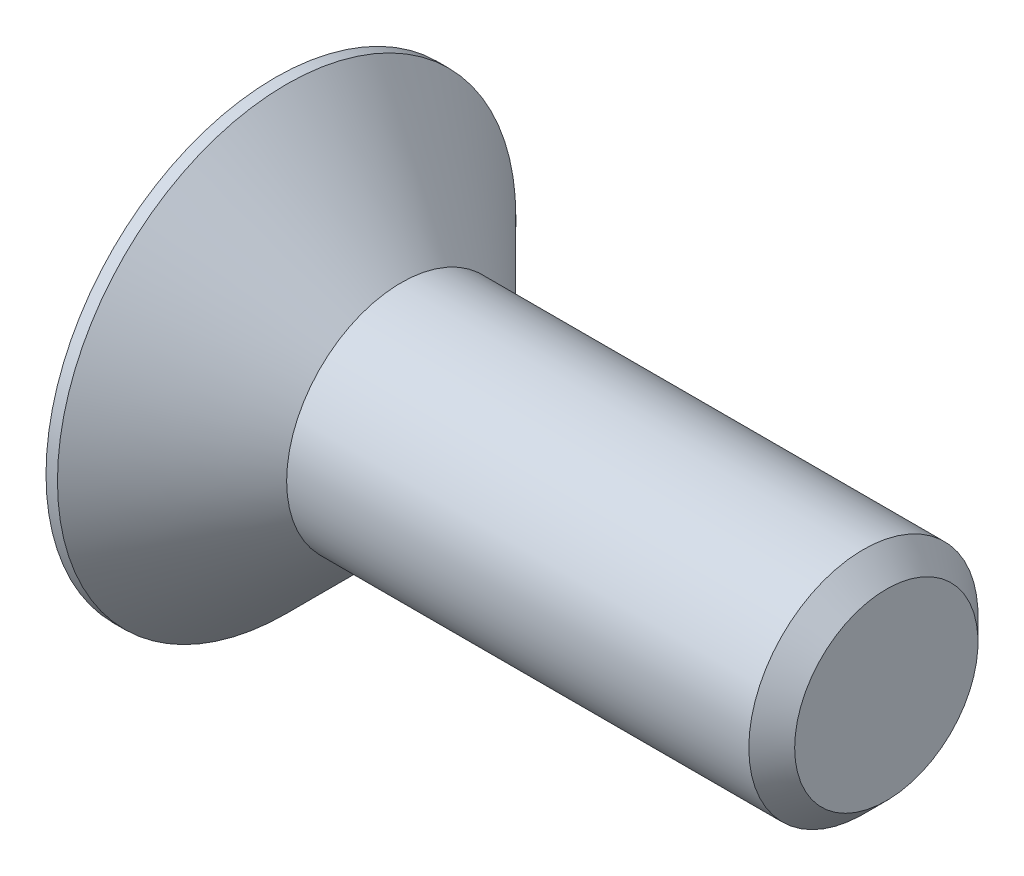
ISO-10303-21;
HEADER;
FILE_DESCRIPTION(('STEP AP214'),'2;1');
FILE_NAME('part.step','',(''),(''),'','','');
FILE_SCHEMA(('AUTOMOTIVE_DESIGN { 1 0 10303 214 1 1 1 1 }'));
ENDSEC;
DATA;
#1=APPLICATION_CONTEXT('core data for automotive mechanical design processes');
#2=APPLICATION_PROTOCOL_DEFINITION('international standard','automotive_design',2000,#1);
#3=PRODUCT_CONTEXT('',#1,'mechanical');
#4=PRODUCT('Part','Part','',(#3));
#5=PRODUCT_RELATED_PRODUCT_CATEGORY('part','',(#4));
#6=PRODUCT_DEFINITION_FORMATION('','',#4);
#7=PRODUCT_DEFINITION_CONTEXT('part definition',#1,'design');
#8=PRODUCT_DEFINITION('design','',#6,#7);
#9=PRODUCT_DEFINITION_SHAPE('','',#8);
#10=(LENGTH_UNIT() NAMED_UNIT(*) SI_UNIT(.MILLI.,.METRE.));
#11=(NAMED_UNIT(*) PLANE_ANGLE_UNIT() SI_UNIT($,.RADIAN.));
#12=(NAMED_UNIT(*) SI_UNIT($,.STERADIAN.) SOLID_ANGLE_UNIT());
#13=UNCERTAINTY_MEASURE_WITH_UNIT(LENGTH_MEASURE(1.E-05),#10,'distance_accuracy_value','');
#14=(GEOMETRIC_REPRESENTATION_CONTEXT(3) GLOBAL_UNCERTAINTY_ASSIGNED_CONTEXT((#13)) GLOBAL_UNIT_ASSIGNED_CONTEXT((#10,
#11,#12)) REPRESENTATION_CONTEXT('',''));
#15=CARTESIAN_POINT('',(0.,0.,0.));
#16=DIRECTION('',(0.,0.,1.));
#17=DIRECTION('',(1.,0.,0.));
#18=AXIS2_PLACEMENT_3D('',#15,#16,#17);
#19=CARTESIAN_POINT('',(1.64999999999879,-32.4759528843813,-18.7499996515608));
#20=DIRECTION('',(-1.,0.,0.));
#21=DIRECTION('',(0.,0.,1.));
#22=AXIS2_PLACEMENT_3D('',#19,#20,#21);
#23=PLANE('',#22);
#24=DIRECTION('',(0.,-0.5,0.866025403784439));
#25=VECTOR('',#24,1.);
#26=CARTESIAN_POINT('',(1.64999999999879,-30.7439020768125,-17.7499996515608));
#27=LINE('',#26,#25);
#28=CARTESIAN_POINT('',(1.64999999999879,-31.3212523460021,-16.7499996515608));
#29=VERTEX_POINT('',#28);
#30=CARTESIAN_POINT('',(1.64999999999879,-30.1665518076228,-18.7499996515608));
#31=VERTEX_POINT('',#30);
#32=EDGE_CURVE('E83',#29,#31,#27,.F.);
#33=ORIENTED_EDGE('',*,*,#32,.T.);
#34=DIRECTION('',(0.,0.5,0.866025403784439));
#35=VECTOR('',#34,1.);
#36=CARTESIAN_POINT('',(1.64999999999879,-30.7439020768125,-19.7499996515608));
#37=LINE('',#36,#35);
#38=CARTESIAN_POINT('',(1.64999999999879,-31.3212523460021,-20.7499996515608));
#39=VERTEX_POINT('',#38);
#40=EDGE_CURVE('E67',#31,#39,#37,.F.);
#41=ORIENTED_EDGE('',*,*,#40,.T.);
#42=DIRECTION('',(0.,1.,0.));
#43=VECTOR('',#42,1.);
#44=CARTESIAN_POINT('',(1.64999999999879,-32.4759528843813,-20.7499996515608));
#45=LINE('',#44,#43);
#46=CARTESIAN_POINT('',(1.64999999999879,-33.6306534227606,-20.7499996515608));
#47=VERTEX_POINT('',#46);
#48=EDGE_CURVE('E72',#39,#47,#45,.F.);
#49=ORIENTED_EDGE('',*,*,#48,.T.);
#50=DIRECTION('',(0.,0.5,-0.866025403784439));
#51=VECTOR('',#50,1.);
#52=CARTESIAN_POINT('',(1.64999999999879,-34.2080036919502,-19.7499996515608));
#53=LINE('',#52,#51);
#54=CARTESIAN_POINT('',(1.64999999999879,-34.7853539611398,-18.7499996515608));
#55=VERTEX_POINT('',#54);
#56=EDGE_CURVE('E121',#47,#55,#53,.F.);
#57=ORIENTED_EDGE('',*,*,#56,.T.);
#58=DIRECTION('',(0.,-0.5,-0.866025403784439));
#59=VECTOR('',#58,1.);
#60=CARTESIAN_POINT('',(1.64999999999879,-34.2080036919502,-17.7499996515608));
#61=LINE('',#60,#59);
#62=CARTESIAN_POINT('',(1.64999999999879,-33.6306534227606,-16.7499996515608));
#63=VERTEX_POINT('',#62);
#64=EDGE_CURVE('E125',#55,#63,#61,.F.);
#65=ORIENTED_EDGE('',*,*,#64,.T.);
#66=DIRECTION('',(0.,1.,0.));
#67=VECTOR('',#66,1.);
#68=CARTESIAN_POINT('',(1.64999999999879,-32.4759528843813,-16.7499996515608));
#69=LINE('',#68,#67);
#70=EDGE_CURVE('E130',#63,#29,#69,.T.);
#71=ORIENTED_EDGE('',*,*,#70,.T.);
#72=EDGE_LOOP('',(#33,#41,#49,#57,#65,#71));
#73=FACE_BOUND('',#72,.T.);
#74=ADVANCED_FACE('F17',(#73),#23,.T.);
#75=CARTESIAN_POINT('',(-1.20823620206045E-12,-32.4759528843813,-20.7499996515608));
#76=DIRECTION('',(0.,0.,-1.));
#77=DIRECTION('',(-1.,0.,0.));
#78=AXIS2_PLACEMENT_3D('',#75,#76,#77);
#79=PLANE('',#78);
#80=DIRECTION('',(1.,0.,0.));
#81=VECTOR('',#80,1.);
#82=CARTESIAN_POINT('',(-1.20811374142507E-12,-31.3212523460021,-20.7499996515608));
#83=LINE('',#82,#81);
#84=CARTESIAN_POINT('',(-1.20823620206045E-12,-31.3212523460021,-20.7499996515608));
#85=VERTEX_POINT('',#84);
#86=EDGE_CURVE('E74',#39,#85,#83,.F.);
#87=ORIENTED_EDGE('',*,*,#86,.T.);
#88=DIRECTION('',(0.,1.,0.));
#89=VECTOR('',#88,1.);
#90=CARTESIAN_POINT('',(-1.20823620206045E-12,-32.4759528843813,-20.7499996515608));
#91=LINE('',#90,#89);
#92=CARTESIAN_POINT('',(-1.20817497174276E-12,-33.6306534227606,-20.7499996515608));
#93=VERTEX_POINT('',#92);
#94=EDGE_CURVE('E119',#93,#85,#91,.T.);
#95=ORIENTED_EDGE('',*,*,#94,.F.);
#96=DIRECTION('',(1.,0.,0.));
#97=VECTOR('',#96,1.);
#98=CARTESIAN_POINT('',(-1.20811374142507E-12,-33.6306534227606,-20.7499996515608));
#99=LINE('',#98,#97);
#100=EDGE_CURVE('E77',#93,#47,#99,.T.);
#101=ORIENTED_EDGE('',*,*,#100,.T.);
#102=ORIENTED_EDGE('',*,*,#48,.F.);
#103=EDGE_LOOP('',(#87,#95,#101,#102));
#104=FACE_BOUND('',#103,.T.);
#105=ADVANCED_FACE('F73',(#104),#79,.F.);
#106=CARTESIAN_POINT('',(-1.20811374142507E-12,-30.7439020768125,-19.7499996515608));
#107=DIRECTION('',(0.,0.866025403784439,-0.5));
#108=DIRECTION('',(0.,0.5,0.866025403784439));
#109=AXIS2_PLACEMENT_3D('',#106,#107,#108);
#110=PLANE('',#109);
#111=DIRECTION('',(1.,0.,0.));
#112=VECTOR('',#111,1.);
#113=CARTESIAN_POINT('',(-1.20786882015431E-12,-30.1665518076229,-18.7499996515608));
#114=LINE('',#113,#112);
#115=CARTESIAN_POINT('',(-1.20811374142507E-12,-30.1665518076228,-18.7499996515608));
#116=VERTEX_POINT('',#115);
#117=EDGE_CURVE('E85',#31,#116,#114,.F.);
#118=ORIENTED_EDGE('',*,*,#117,.T.);
#119=DIRECTION('',(0.,0.500000000000017,0.866025403784429));
#120=VECTOR('',#119,1.);
#121=CARTESIAN_POINT('',(-1.20823620206045E-12,-31.3212523460021,-20.7499996515608));
#122=LINE('',#121,#120);
#123=EDGE_CURVE('E89',#85,#116,#122,.T.);
#124=ORIENTED_EDGE('',*,*,#123,.F.);
#125=ORIENTED_EDGE('',*,*,#86,.F.);
#126=ORIENTED_EDGE('',*,*,#40,.F.);
#127=EDGE_LOOP('',(#118,#124,#125,#126));
#128=FACE_BOUND('',#127,.T.);
#129=ADVANCED_FACE('F87',(#128),#110,.F.);
#130=CARTESIAN_POINT('',(-1.20786882015431E-12,-30.7439020768125,-17.7499996515608));
#131=DIRECTION('',(0.,0.866025403784439,0.5));
#132=DIRECTION('',(0.,-0.5,0.866025403784439));
#133=AXIS2_PLACEMENT_3D('',#130,#131,#132);
#134=PLANE('',#133);
#135=DIRECTION('',(1.,0.,0.));
#136=VECTOR('',#135,1.);
#137=CARTESIAN_POINT('',(-1.20774635951892E-12,-31.3212523460021,-16.7499996515608));
#138=LINE('',#137,#136);
#139=CARTESIAN_POINT('',(-1.20786882015431E-12,-31.3212523460021,-16.7499996515608));
#140=VERTEX_POINT('',#139);
#141=EDGE_CURVE('E132',#29,#140,#138,.F.);
#142=ORIENTED_EDGE('',*,*,#141,.T.);
#143=DIRECTION('',(0.,-0.500000000000018,0.866025403784428));
#144=VECTOR('',#143,1.);
#145=CARTESIAN_POINT('',(-1.20799128078969E-12,-30.1665518076228,-18.7499996515608));
#146=LINE('',#145,#144);
#147=EDGE_CURVE('E115',#116,#140,#146,.T.);
#148=ORIENTED_EDGE('',*,*,#147,.F.);
#149=ORIENTED_EDGE('',*,*,#117,.F.);
#150=ORIENTED_EDGE('',*,*,#32,.F.);
#151=EDGE_LOOP('',(#142,#148,#149,#150));
#152=FACE_BOUND('',#151,.T.);
#153=ADVANCED_FACE('F136',(#152),#134,.F.);
#154=CARTESIAN_POINT('',(-1.20774635951892E-12,-32.4759528843813,-16.7499996515608));
#155=DIRECTION('',(0.,0.,1.));
#156=DIRECTION('',(1.,0.,0.));
#157=AXIS2_PLACEMENT_3D('',#154,#155,#156);
#158=PLANE('',#157);
#159=DIRECTION('',(1.,0.,0.));
#160=VECTOR('',#159,1.);
#161=CARTESIAN_POINT('',(-1.20786882015431E-12,-33.6306534227606,-16.7499996515608));
#162=LINE('',#161,#160);
#163=CARTESIAN_POINT('',(-1.20774635951892E-12,-33.6306534227606,-16.7499996515608));
#164=VERTEX_POINT('',#163);
#165=EDGE_CURVE('E128',#63,#164,#162,.F.);
#166=ORIENTED_EDGE('',*,*,#165,.T.);
#167=DIRECTION('',(0.,1.,0.));
#168=VECTOR('',#167,1.);
#169=CARTESIAN_POINT('',(-1.20774635951892E-12,-32.4759528843813,-16.7499996515608));
#170=LINE('',#169,#168);
#171=EDGE_CURVE('E109',#140,#164,#170,.F.);
#172=ORIENTED_EDGE('',*,*,#171,.F.);
#173=ORIENTED_EDGE('',*,*,#141,.F.);
#174=ORIENTED_EDGE('',*,*,#70,.F.);
#175=EDGE_LOOP('',(#166,#172,#173,#174));
#176=FACE_BOUND('',#175,.T.);
#177=ADVANCED_FACE('F145',(#176),#158,.F.);
#178=CARTESIAN_POINT('',(-1.20786882015431E-12,-34.2080036919502,-17.7499996515608));
#179=DIRECTION('',(0.,-0.866025403784439,0.5));
#180=DIRECTION('',(0.,-0.5,-0.866025403784439));
#181=AXIS2_PLACEMENT_3D('',#178,#179,#180);
#182=PLANE('',#181);
#183=DIRECTION('',(1.,0.,0.));
#184=VECTOR('',#183,1.);
#185=CARTESIAN_POINT('',(-1.20811374142507E-12,-34.7853539611398,-18.7499996515608));
#186=LINE('',#185,#184);
#187=CARTESIAN_POINT('',(-1.2078688201543E-12,-34.7853539611398,-18.7499996515608));
#188=VERTEX_POINT('',#187);
#189=EDGE_CURVE('E35',#55,#188,#186,.F.);
#190=ORIENTED_EDGE('',*,*,#189,.T.);
#191=DIRECTION('',(0.,-0.499999999999983,-0.866025403784449));
#192=VECTOR('',#191,1.);
#193=CARTESIAN_POINT('',(-1.20774635951892E-12,-33.6306534227606,-16.7499996515608));
#194=LINE('',#193,#192);
#195=EDGE_CURVE('E105',#164,#188,#194,.T.);
#196=ORIENTED_EDGE('',*,*,#195,.F.);
#197=ORIENTED_EDGE('',*,*,#165,.F.);
#198=ORIENTED_EDGE('',*,*,#64,.F.);
#199=EDGE_LOOP('',(#190,#196,#197,#198));
#200=FACE_BOUND('',#199,.T.);
#201=ADVANCED_FACE('F143',(#200),#182,.F.);
#202=CARTESIAN_POINT('',(-1.20811374142507E-12,-34.2080036919502,-19.7499996515608));
#203=DIRECTION('',(0.,-0.866025403784439,-0.5));
#204=DIRECTION('',(0.,0.5,-0.866025403784439));
#205=AXIS2_PLACEMENT_3D('',#202,#203,#204);
#206=PLANE('',#205);
#207=ORIENTED_EDGE('',*,*,#100,.F.);
#208=DIRECTION('',(0.,0.499999999999982,-0.866025403784449));
#209=VECTOR('',#208,1.);
#210=CARTESIAN_POINT('',(-1.20799128078969E-12,-34.7853539611398,-18.7499996515608));
#211=LINE('',#210,#209);
#212=EDGE_CURVE('E101',#188,#93,#211,.T.);
#213=ORIENTED_EDGE('',*,*,#212,.F.);
#214=ORIENTED_EDGE('',*,*,#189,.F.);
#215=ORIENTED_EDGE('',*,*,#56,.F.);
#216=EDGE_LOOP('',(#207,#213,#214,#215));
#217=FACE_BOUND('',#216,.T.);
#218=ADVANCED_FACE('F141',(#217),#206,.F.);
#219=CARTESIAN_POINT('',(-1.20762389888354E-12,-32.4759528843813,-15.7499996515608));
#220=DIRECTION('',(-1.,0.,0.));
#221=DIRECTION('',(0.,0.,1.));
#222=AXIS2_PLACEMENT_3D('',#219,#220,#221);
#223=PLANE('',#222);
#224=CARTESIAN_POINT('',(-1.2079096403661E-12,-32.4759528843813,-18.7499996515608));
#225=DIRECTION('',(-1.,0.,0.));
#226=DIRECTION('',(0.,0.,1.));
#227=AXIS2_PLACEMENT_3D('',#224,#225,#226);
#228=CIRCLE('',#227,6.);
#229=CARTESIAN_POINT('',(-1.20724350655133E-12,-32.4759528843813,-12.7499996515608));
#230=VERTEX_POINT('',#229);
#231=EDGE_CURVE('E20',#230,#230,#228,.F.);
#232=ORIENTED_EDGE('',*,*,#231,.F.);
#233=EDGE_LOOP('',(#232));
#234=FACE_BOUND('',#233,.T.);
#235=ORIENTED_EDGE('',*,*,#195,.T.);
#236=ORIENTED_EDGE('',*,*,#212,.T.);
#237=ORIENTED_EDGE('',*,*,#94,.T.);
#238=ORIENTED_EDGE('',*,*,#123,.T.);
#239=ORIENTED_EDGE('',*,*,#147,.T.);
#240=ORIENTED_EDGE('',*,*,#171,.T.);
#241=EDGE_LOOP('',(#235,#236,#237,#238,#239,#240));
#242=FACE_BOUND('',#241,.T.);
#243=ADVANCED_FACE('F139',(#234,#242),#223,.T.);
#244=CARTESIAN_POINT('',(15.9999999999988,-32.4759528843813,-17.2499996515608));
#245=DIRECTION('',(1.,0.,0.));
#246=DIRECTION('',(0.,0.,-1.));
#247=AXIS2_PLACEMENT_3D('',#244,#245,#246);
#248=PLANE('',#247);
#249=CARTESIAN_POINT('',(16.0000000000196,-32.4759528843813,-18.7499996515608));
#250=DIRECTION('',(-1.,0.,0.));
#251=DIRECTION('',(0.,0.,1.));
#252=AXIS2_PLACEMENT_3D('',#249,#250,#251);
#253=CIRCLE('',#252,2.40000000002324);
#254=CARTESIAN_POINT('',(16.0000000000196,-32.4759528843813,-16.3499996515376));
#255=VERTEX_POINT('',#254);
#256=EDGE_CURVE('E96',#255,#255,#253,.T.);
#257=ORIENTED_EDGE('',*,*,#256,.F.);
#258=EDGE_LOOP('',(#257));
#259=FACE_BOUND('',#258,.T.);
#260=ADVANCED_FACE('F175',(#259),#248,.T.);
#261=CARTESIAN_POINT('',(0.149999999998793,-32.4759528843813,-18.7499996515608));
#262=DIRECTION('',(-1.,0.,0.));
#263=DIRECTION('',(0.,0.,1.));
#264=AXIS2_PLACEMENT_3D('',#261,#262,#263);
#265=CYLINDRICAL_SURFACE('',#264,6.);
#266=ORIENTED_EDGE('',*,*,#231,.T.);
#267=EDGE_LOOP('',(#266));
#268=FACE_BOUND('',#267,.T.);
#269=CARTESIAN_POINT('',(0.299999999924693,-32.4759528843813,-18.7499996515608));
#270=DIRECTION('',(-1.,0.,0.));
#271=DIRECTION('',(0.,0.,1.));
#272=AXIS2_PLACEMENT_3D('',#269,#270,#271);
#273=CIRCLE('',#272,6.00000000002824);
#274=CARTESIAN_POINT('',(0.299999999924694,-32.4759528843813,-12.7499996515326));
#275=VERTEX_POINT('',#274);
#276=EDGE_CURVE('E94',#275,#275,#273,.F.);
#277=ORIENTED_EDGE('',*,*,#276,.F.);
#278=EDGE_LOOP('',(#277));
#279=FACE_BOUND('',#278,.T.);
#280=ADVANCED_FACE('F171',(#268,#279),#265,.T.);
#281=CARTESIAN_POINT('',(15.3999999999996,-32.4759528843813,-18.7499996515608));
#282=DIRECTION('',(-1.,0.,0.));
#283=DIRECTION('',(0.,0.,1.));
#284=AXIS2_PLACEMENT_3D('',#281,#282,#283);
#285=CONICAL_SURFACE('',#284,3.00000000004316,0.785398163397448);
#286=CARTESIAN_POINT('',(15.3999999999988,-32.4759528843813,-18.7499996515608));
#287=DIRECTION('',(-1.,0.,0.));
#288=DIRECTION('',(0.,0.,1.));
#289=AXIS2_PLACEMENT_3D('',#286,#287,#288);
#290=CIRCLE('',#289,3.);
#291=CARTESIAN_POINT('',(15.3999999999988,-32.4759528843813,-15.7499996515608));
#292=VERTEX_POINT('',#291);
#293=EDGE_CURVE('E26',#292,#292,#290,.T.);
#294=ORIENTED_EDGE('',*,*,#293,.F.);
#295=EDGE_LOOP('',(#294));
#296=FACE_BOUND('',#295,.T.);
#297=ORIENTED_EDGE('',*,*,#256,.T.);
#298=EDGE_LOOP('',(#297));
#299=FACE_BOUND('',#298,.T.);
#300=ADVANCED_FACE('F163',(#296,#299),#285,.T.);
#301=CARTESIAN_POINT('',(0.299999999924694,-32.4759528843813,-18.7499996515608));
#302=DIRECTION('',(-1.,0.,0.));
#303=DIRECTION('',(0.,0.,1.));
#304=AXIS2_PLACEMENT_3D('',#301,#302,#303);
#305=CONICAL_SURFACE('',#304,6.00000000002824,0.785398163397448);
#306=CARTESIAN_POINT('',(3.29999999999879,-32.4759528843813,-18.7499996515608));
#307=DIRECTION('',(-1.,0.,0.));
#308=DIRECTION('',(0.,0.,1.));
#309=AXIS2_PLACEMENT_3D('',#306,#307,#308);
#310=CIRCLE('',#309,3.);
#311=CARTESIAN_POINT('',(3.29999999999879,-32.4759528843813,-15.7499996515608));
#312=VERTEX_POINT('',#311);
#313=EDGE_CURVE('E11',#312,#312,#310,.F.);
#314=ORIENTED_EDGE('',*,*,#313,.F.);
#315=EDGE_LOOP('',(#314));
#316=FACE_BOUND('',#315,.T.);
#317=ORIENTED_EDGE('',*,*,#276,.T.);
#318=EDGE_LOOP('',(#317));
#319=FACE_BOUND('',#318,.T.);
#320=ADVANCED_FACE('F157',(#316,#319),#305,.T.);
#321=CARTESIAN_POINT('',(9.64999999999879,-32.4759528843813,-18.7499996515608));
#322=DIRECTION('',(-1.,0.,0.));
#323=DIRECTION('',(0.,0.,1.));
#324=AXIS2_PLACEMENT_3D('',#321,#322,#323);
#325=CYLINDRICAL_SURFACE('',#324,3.);
#326=ORIENTED_EDGE('',*,*,#293,.T.);
#327=EDGE_LOOP('',(#326));
#328=FACE_BOUND('',#327,.T.);
#329=ORIENTED_EDGE('',*,*,#313,.T.);
#330=EDGE_LOOP('',(#329));
#331=FACE_BOUND('',#330,.T.);
#332=ADVANCED_FACE('F155',(#328,#331),#325,.T.);
#333=CLOSED_SHELL('',(#74,#105,#129,#153,#177,#201,#218,#243,#260,#280,#300,#320,#332));
#334=MANIFOLD_SOLID_BREP('B1',#333);
#335=ADVANCED_BREP_SHAPE_REPRESENTATION('',(#18,#334),#14);
#336=SHAPE_DEFINITION_REPRESENTATION(#9,#335);
ENDSEC;
END-ISO-10303-21;
